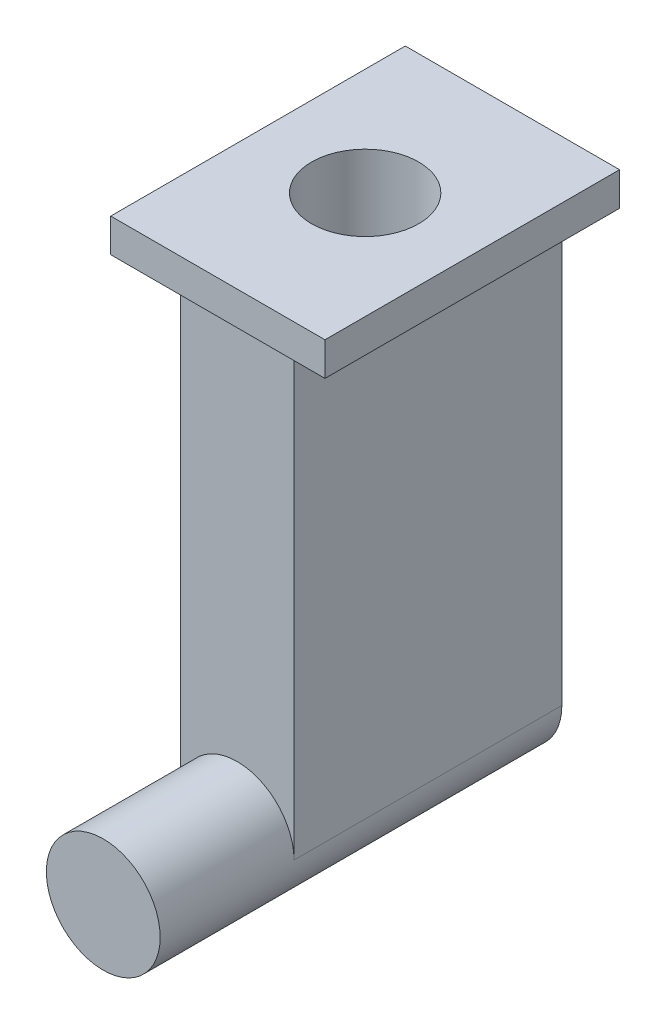
ISO-10303-21;
HEADER;
FILE_DESCRIPTION(('STEP AP214'),'2;1');
FILE_NAME('part.step','',(''),(''),'','','');
FILE_SCHEMA(('AUTOMOTIVE_DESIGN { 1 0 10303 214 1 1 1 1 }'));
ENDSEC;
DATA;
#1=APPLICATION_CONTEXT('core data for automotive mechanical design processes');
#2=APPLICATION_PROTOCOL_DEFINITION('international standard','automotive_design',2000,#1);
#3=PRODUCT_CONTEXT('',#1,'mechanical');
#4=PRODUCT('Part','Part','',(#3));
#5=PRODUCT_RELATED_PRODUCT_CATEGORY('part','',(#4));
#6=PRODUCT_DEFINITION_FORMATION('','',#4);
#7=PRODUCT_DEFINITION_CONTEXT('part definition',#1,'design');
#8=PRODUCT_DEFINITION('design','',#6,#7);
#9=PRODUCT_DEFINITION_SHAPE('','',#8);
#10=(LENGTH_UNIT() NAMED_UNIT(*) SI_UNIT(.MILLI.,.METRE.));
#11=(NAMED_UNIT(*) PLANE_ANGLE_UNIT() SI_UNIT($,.RADIAN.));
#12=(NAMED_UNIT(*) SI_UNIT($,.STERADIAN.) SOLID_ANGLE_UNIT());
#13=UNCERTAINTY_MEASURE_WITH_UNIT(LENGTH_MEASURE(1.E-05),#10,'distance_accuracy_value','');
#14=(GEOMETRIC_REPRESENTATION_CONTEXT(3) GLOBAL_UNCERTAINTY_ASSIGNED_CONTEXT((#13)) GLOBAL_UNIT_ASSIGNED_CONTEXT((#10,
#11,#12)) REPRESENTATION_CONTEXT('',''));
#15=CARTESIAN_POINT('',(0.,0.,0.));
#16=DIRECTION('',(0.,0.,1.));
#17=DIRECTION('',(1.,0.,0.));
#18=AXIS2_PLACEMENT_3D('',#15,#16,#17);
#19=CARTESIAN_POINT('',(0.,0.,-100.));
#20=DIRECTION('',(0.,0.,1.));
#21=DIRECTION('',(1.,0.,0.));
#22=AXIS2_PLACEMENT_3D('',#19,#20,#21);
#23=CYLINDRICAL_SURFACE('',#22,42.5);
#24=CARTESIAN_POINT('',(0.,0.,-100.));
#25=DIRECTION('',(0.,0.,1.));
#26=DIRECTION('',(1.,0.,0.));
#27=AXIS2_PLACEMENT_3D('',#24,#25,#26);
#28=CIRCLE('',#27,42.5);
#29=CARTESIAN_POINT('',(42.5,0.,-100.));
#30=VERTEX_POINT('',#29);
#31=CARTESIAN_POINT('',(-42.5,0.,-100.));
#32=VERTEX_POINT('',#31);
#33=EDGE_CURVE('E44',#30,#32,#28,.T.);
#34=ORIENTED_EDGE('',*,*,#33,.T.);
#35=DIRECTION('',(0.,0.,1.));
#36=VECTOR('',#35,1.);
#37=CARTESIAN_POINT('',(-42.5,0.,-300.));
#38=LINE('',#37,#36);
#39=CARTESIAN_POINT('',(-42.5,0.,-300.));
#40=VERTEX_POINT('',#39);
#41=EDGE_CURVE('E151',#40,#32,#38,.T.);
#42=ORIENTED_EDGE('',*,*,#41,.F.);
#43=CARTESIAN_POINT('',(0.,0.,-300.));
#44=DIRECTION('',(0.,0.,-1.));
#45=DIRECTION('',(-1.,0.,0.));
#46=AXIS2_PLACEMENT_3D('',#43,#44,#45);
#47=CIRCLE('',#46,42.5);
#48=CARTESIAN_POINT('',(42.5,0.,-300.));
#49=VERTEX_POINT('',#48);
#50=EDGE_CURVE('E138',#49,#40,#47,.T.);
#51=ORIENTED_EDGE('',*,*,#50,.F.);
#52=DIRECTION('',(0.,0.,1.));
#53=VECTOR('',#52,1.);
#54=CARTESIAN_POINT('',(42.5,0.,-300.));
#55=LINE('',#54,#53);
#56=EDGE_CURVE('E146',#49,#30,#55,.T.);
#57=ORIENTED_EDGE('',*,*,#56,.T.);
#58=EDGE_LOOP('',(#34,#42,#51,#57));
#59=FACE_BOUND('',#58,.T.);
#60=CARTESIAN_POINT('',(0.,0.,0.));
#61=DIRECTION('',(0.,0.,1.));
#62=DIRECTION('',(1.,0.,0.));
#63=AXIS2_PLACEMENT_3D('',#60,#61,#62);
#64=CIRCLE('',#63,42.5);
#65=CARTESIAN_POINT('',(42.5,0.,0.));
#66=VERTEX_POINT('',#65);
#67=EDGE_CURVE('E154',#66,#66,#64,.T.);
#68=ORIENTED_EDGE('',*,*,#67,.F.);
#69=EDGE_LOOP('',(#68));
#70=FACE_BOUND('',#69,.T.);
#71=ADVANCED_FACE('F37',(#59,#70),#23,.T.);
#72=CARTESIAN_POINT('',(0.,0.,0.));
#73=DIRECTION('',(0.,0.,1.));
#74=DIRECTION('',(1.,0.,0.));
#75=AXIS2_PLACEMENT_3D('',#72,#73,#74);
#76=PLANE('',#75);
#77=ORIENTED_EDGE('',*,*,#67,.T.);
#78=EDGE_LOOP('',(#77));
#79=FACE_BOUND('',#78,.T.);
#80=ADVANCED_FACE('F159',(#79),#76,.T.);
#81=CARTESIAN_POINT('',(-42.5,0.,-300.));
#82=DIRECTION('',(1.,0.,0.));
#83=DIRECTION('',(0.,0.,-1.));
#84=AXIS2_PLACEMENT_3D('',#81,#82,#83);
#85=PLANE('',#84);
#86=DIRECTION('',(0.,1.,0.));
#87=VECTOR('',#86,1.);
#88=CARTESIAN_POINT('',(-42.5,0.,-100.));
#89=LINE('',#88,#87);
#90=CARTESIAN_POINT('',(-42.5,337.5,-100.));
#91=VERTEX_POINT('',#90);
#92=EDGE_CURVE('E137',#32,#91,#89,.T.);
#93=ORIENTED_EDGE('',*,*,#92,.T.);
#94=DIRECTION('',(0.,0.,-1.));
#95=VECTOR('',#94,1.);
#96=CARTESIAN_POINT('',(-42.5,337.5,-300.));
#97=LINE('',#96,#95);
#98=CARTESIAN_POINT('',(-42.5,337.5,-300.));
#99=VERTEX_POINT('',#98);
#100=EDGE_CURVE('E51',#91,#99,#97,.T.);
#101=ORIENTED_EDGE('',*,*,#100,.T.);
#102=DIRECTION('',(0.,1.,0.));
#103=VECTOR('',#102,1.);
#104=CARTESIAN_POINT('',(-42.5,0.,-300.));
#105=LINE('',#104,#103);
#106=EDGE_CURVE('E141',#40,#99,#105,.T.);
#107=ORIENTED_EDGE('',*,*,#106,.F.);
#108=ORIENTED_EDGE('',*,*,#41,.T.);
#109=EDGE_LOOP('',(#93,#101,#107,#108));
#110=FACE_BOUND('',#109,.T.);
#111=ADVANCED_FACE('F166',(#110),#85,.F.);
#112=CARTESIAN_POINT('',(42.5,0.,-300.));
#113=DIRECTION('',(-1.,0.,0.));
#114=DIRECTION('',(0.,0.,1.));
#115=AXIS2_PLACEMENT_3D('',#112,#113,#114);
#116=PLANE('',#115);
#117=DIRECTION('',(0.,-1.,0.));
#118=VECTOR('',#117,1.);
#119=CARTESIAN_POINT('',(42.5,0.,-300.));
#120=LINE('',#119,#118);
#121=CARTESIAN_POINT('',(42.5,337.5,-300.));
#122=VERTEX_POINT('',#121);
#123=EDGE_CURVE('E144',#122,#49,#120,.T.);
#124=ORIENTED_EDGE('',*,*,#123,.F.);
#125=DIRECTION('',(0.,0.,1.));
#126=VECTOR('',#125,1.);
#127=CARTESIAN_POINT('',(42.5,337.5,-300.));
#128=LINE('',#127,#126);
#129=CARTESIAN_POINT('',(42.5,337.5,-100.));
#130=VERTEX_POINT('',#129);
#131=EDGE_CURVE('E127',#122,#130,#128,.T.);
#132=ORIENTED_EDGE('',*,*,#131,.T.);
#133=DIRECTION('',(0.,-1.,0.));
#134=VECTOR('',#133,1.);
#135=CARTESIAN_POINT('',(42.5,0.,-100.));
#136=LINE('',#135,#134);
#137=EDGE_CURVE('E58',#130,#30,#136,.T.);
#138=ORIENTED_EDGE('',*,*,#137,.T.);
#139=ORIENTED_EDGE('',*,*,#56,.F.);
#140=EDGE_LOOP('',(#124,#132,#138,#139));
#141=FACE_BOUND('',#140,.T.);
#142=ADVANCED_FACE('F177',(#141),#116,.F.);
#143=CARTESIAN_POINT('',(0.,0.,-300.));
#144=DIRECTION('',(0.,0.,-1.));
#145=DIRECTION('',(-1.,0.,0.));
#146=AXIS2_PLACEMENT_3D('',#143,#144,#145);
#147=PLANE('',#146);
#148=DIRECTION('',(-1.,0.,0.));
#149=VECTOR('',#148,1.);
#150=CARTESIAN_POINT('',(0.,337.5,-300.));
#151=LINE('',#150,#149);
#152=EDGE_CURVE('E135',#122,#99,#151,.T.);
#153=ORIENTED_EDGE('',*,*,#152,.F.);
#154=ORIENTED_EDGE('',*,*,#123,.T.);
#155=ORIENTED_EDGE('',*,*,#50,.T.);
#156=ORIENTED_EDGE('',*,*,#106,.T.);
#157=EDGE_LOOP('',(#153,#154,#155,#156));
#158=FACE_BOUND('',#157,.T.);
#159=ADVANCED_FACE('F175',(#158),#147,.T.);
#160=CARTESIAN_POINT('',(0.,0.,-100.));
#161=DIRECTION('',(0.,0.,-1.));
#162=DIRECTION('',(-1.,0.,0.));
#163=AXIS2_PLACEMENT_3D('',#160,#161,#162);
#164=PLANE('',#163);
#165=ORIENTED_EDGE('',*,*,#137,.F.);
#166=DIRECTION('',(-1.,0.,0.));
#167=VECTOR('',#166,1.);
#168=CARTESIAN_POINT('',(0.,337.5,-100.));
#169=LINE('',#168,#167);
#170=EDGE_CURVE('E11',#130,#91,#169,.T.);
#171=ORIENTED_EDGE('',*,*,#170,.T.);
#172=ORIENTED_EDGE('',*,*,#92,.F.);
#173=ORIENTED_EDGE('',*,*,#33,.F.);
#174=EDGE_LOOP('',(#165,#171,#172,#173));
#175=FACE_BOUND('',#174,.T.);
#176=ADVANCED_FACE('F171',(#175),#164,.F.);
#177=CARTESIAN_POINT('',(80.,362.5,-85.5773193014161));
#178=DIRECTION('',(-1.,0.,0.));
#179=DIRECTION('',(0.,0.,1.));
#180=AXIS2_PLACEMENT_3D('',#177,#178,#179);
#181=PLANE('',#180);
#182=DIRECTION('',(0.,0.,-1.));
#183=VECTOR('',#182,1.);
#184=CARTESIAN_POINT('',(80.,337.5,-85.5773193014161));
#185=LINE('',#184,#183);
#186=CARTESIAN_POINT('',(80.,337.5,-85.5773193014161));
#187=VERTEX_POINT('',#186);
#188=CARTESIAN_POINT('',(80.,337.5,-305.577319301416));
#189=VERTEX_POINT('',#188);
#190=EDGE_CURVE('E126',#187,#189,#185,.T.);
#191=ORIENTED_EDGE('',*,*,#190,.T.);
#192=DIRECTION('',(0.,-1.,0.));
#193=VECTOR('',#192,1.);
#194=CARTESIAN_POINT('',(80.,362.5,-305.577319301416));
#195=LINE('',#194,#193);
#196=CARTESIAN_POINT('',(80.,362.5,-305.577319301416));
#197=VERTEX_POINT('',#196);
#198=EDGE_CURVE('E106',#197,#189,#195,.T.);
#199=ORIENTED_EDGE('',*,*,#198,.F.);
#200=DIRECTION('',(0.,0.,-1.));
#201=VECTOR('',#200,1.);
#202=CARTESIAN_POINT('',(80.,362.5,-85.5773193014161));
#203=LINE('',#202,#201);
#204=CARTESIAN_POINT('',(80.,362.5,-85.5773193014161));
#205=VERTEX_POINT('',#204);
#206=EDGE_CURVE('E113',#205,#197,#203,.T.);
#207=ORIENTED_EDGE('',*,*,#206,.F.);
#208=DIRECTION('',(0.,-1.,0.));
#209=VECTOR('',#208,1.);
#210=CARTESIAN_POINT('',(80.,362.5,-85.5773193014161));
#211=LINE('',#210,#209);
#212=EDGE_CURVE('E227',#205,#187,#211,.T.);
#213=ORIENTED_EDGE('',*,*,#212,.T.);
#214=EDGE_LOOP('',(#191,#199,#207,#213));
#215=FACE_BOUND('',#214,.T.);
#216=ADVANCED_FACE('F124',(#215),#181,.F.);
#217=CARTESIAN_POINT('',(-80.,362.5,-305.577319301416));
#218=DIRECTION('',(0.,0.,1.));
#219=DIRECTION('',(1.,0.,0.));
#220=AXIS2_PLACEMENT_3D('',#217,#218,#219);
#221=PLANE('',#220);
#222=DIRECTION('',(-1.,0.,0.));
#223=VECTOR('',#222,1.);
#224=CARTESIAN_POINT('',(-80.,337.5,-305.577319301416));
#225=LINE('',#224,#223);
#226=CARTESIAN_POINT('',(-80.,337.5,-305.577319301416));
#227=VERTEX_POINT('',#226);
#228=EDGE_CURVE('E221',#189,#227,#225,.T.);
#229=ORIENTED_EDGE('',*,*,#228,.T.);
#230=DIRECTION('',(0.,-1.,0.));
#231=VECTOR('',#230,1.);
#232=CARTESIAN_POINT('',(-80.,362.5,-305.577319301416));
#233=LINE('',#232,#231);
#234=CARTESIAN_POINT('',(-80.,362.5,-305.577319301416));
#235=VERTEX_POINT('',#234);
#236=EDGE_CURVE('E109',#235,#227,#233,.T.);
#237=ORIENTED_EDGE('',*,*,#236,.F.);
#238=DIRECTION('',(-1.,0.,0.));
#239=VECTOR('',#238,1.);
#240=CARTESIAN_POINT('',(-80.,362.5,-305.577319301416));
#241=LINE('',#240,#239);
#242=EDGE_CURVE('E102',#197,#235,#241,.T.);
#243=ORIENTED_EDGE('',*,*,#242,.F.);
#244=ORIENTED_EDGE('',*,*,#198,.T.);
#245=EDGE_LOOP('',(#229,#237,#243,#244));
#246=FACE_BOUND('',#245,.T.);
#247=ADVANCED_FACE('F104',(#246),#221,.F.);
#248=CARTESIAN_POINT('',(-80.,362.5,-85.5773193014161));
#249=DIRECTION('',(1.,0.,0.));
#250=DIRECTION('',(0.,0.,-1.));
#251=AXIS2_PLACEMENT_3D('',#248,#249,#250);
#252=PLANE('',#251);
#253=DIRECTION('',(0.,0.,1.));
#254=VECTOR('',#253,1.);
#255=CARTESIAN_POINT('',(-80.,337.5,-85.5773193014161));
#256=LINE('',#255,#254);
#257=CARTESIAN_POINT('',(-80.,337.5,-85.5773193014161));
#258=VERTEX_POINT('',#257);
#259=EDGE_CURVE('E230',#227,#258,#256,.T.);
#260=ORIENTED_EDGE('',*,*,#259,.T.);
#261=DIRECTION('',(0.,-1.,0.));
#262=VECTOR('',#261,1.);
#263=CARTESIAN_POINT('',(-80.,362.5,-85.5773193014161));
#264=LINE('',#263,#262);
#265=CARTESIAN_POINT('',(-80.,362.5,-85.5773193014161));
#266=VERTEX_POINT('',#265);
#267=EDGE_CURVE('E130',#266,#258,#264,.T.);
#268=ORIENTED_EDGE('',*,*,#267,.F.);
#269=DIRECTION('',(0.,0.,1.));
#270=VECTOR('',#269,1.);
#271=CARTESIAN_POINT('',(-80.,362.5,-85.5773193014161));
#272=LINE('',#271,#270);
#273=EDGE_CURVE('E112',#235,#266,#272,.T.);
#274=ORIENTED_EDGE('',*,*,#273,.F.);
#275=ORIENTED_EDGE('',*,*,#236,.T.);
#276=EDGE_LOOP('',(#260,#268,#274,#275));
#277=FACE_BOUND('',#276,.T.);
#278=ADVANCED_FACE('F193',(#277),#252,.F.);
#279=CARTESIAN_POINT('',(-80.,362.5,-85.5773193014161));
#280=DIRECTION('',(0.,0.,-1.));
#281=DIRECTION('',(-1.,0.,0.));
#282=AXIS2_PLACEMENT_3D('',#279,#280,#281);
#283=PLANE('',#282);
#284=DIRECTION('',(1.,0.,0.));
#285=VECTOR('',#284,1.);
#286=CARTESIAN_POINT('',(-80.,337.5,-85.5773193014161));
#287=LINE('',#286,#285);
#288=EDGE_CURVE('E122',#258,#187,#287,.T.);
#289=ORIENTED_EDGE('',*,*,#288,.T.);
#290=ORIENTED_EDGE('',*,*,#212,.F.);
#291=DIRECTION('',(1.,0.,0.));
#292=VECTOR('',#291,1.);
#293=CARTESIAN_POINT('',(-80.,362.5,-85.5773193014161));
#294=LINE('',#293,#292);
#295=EDGE_CURVE('E118',#266,#205,#294,.T.);
#296=ORIENTED_EDGE('',*,*,#295,.F.);
#297=ORIENTED_EDGE('',*,*,#267,.T.);
#298=EDGE_LOOP('',(#289,#290,#296,#297));
#299=FACE_BOUND('',#298,.T.);
#300=ADVANCED_FACE('F196',(#299),#283,.F.);
#301=CARTESIAN_POINT('',(0.,362.5,0.));
#302=DIRECTION('',(0.,-1.,0.));
#303=DIRECTION('',(0.,0.,-1.));
#304=AXIS2_PLACEMENT_3D('',#301,#302,#303);
#305=PLANE('',#304);
#306=CARTESIAN_POINT('',(0.,362.5,-195.577319301416));
#307=DIRECTION('',(0.,1.,0.));
#308=DIRECTION('',(0.,0.,1.));
#309=AXIS2_PLACEMENT_3D('',#306,#307,#308);
#310=CIRCLE('',#309,40.);
#311=CARTESIAN_POINT('',(0.,362.5,-155.577319301416));
#312=VERTEX_POINT('',#311);
#313=EDGE_CURVE('E219',#312,#312,#310,.T.);
#314=ORIENTED_EDGE('',*,*,#313,.F.);
#315=EDGE_LOOP('',(#314));
#316=FACE_BOUND('',#315,.T.);
#317=ORIENTED_EDGE('',*,*,#206,.T.);
#318=ORIENTED_EDGE('',*,*,#242,.T.);
#319=ORIENTED_EDGE('',*,*,#273,.T.);
#320=ORIENTED_EDGE('',*,*,#295,.T.);
#321=EDGE_LOOP('',(#317,#318,#319,#320));
#322=FACE_BOUND('',#321,.T.);
#323=ADVANCED_FACE('F116',(#316,#322),#305,.F.);
#324=CARTESIAN_POINT('',(0.,337.5,0.));
#325=DIRECTION('',(0.,-1.,0.));
#326=DIRECTION('',(0.,0.,-1.));
#327=AXIS2_PLACEMENT_3D('',#324,#325,#326);
#328=PLANE('',#327);
#329=ORIENTED_EDGE('',*,*,#131,.F.);
#330=ORIENTED_EDGE('',*,*,#152,.T.);
#331=ORIENTED_EDGE('',*,*,#100,.F.);
#332=ORIENTED_EDGE('',*,*,#170,.F.);
#333=EDGE_LOOP('',(#329,#330,#331,#332));
#334=FACE_BOUND('',#333,.T.);
#335=ORIENTED_EDGE('',*,*,#190,.F.);
#336=ORIENTED_EDGE('',*,*,#288,.F.);
#337=ORIENTED_EDGE('',*,*,#259,.F.);
#338=ORIENTED_EDGE('',*,*,#228,.F.);
#339=EDGE_LOOP('',(#335,#336,#337,#338));
#340=FACE_BOUND('',#339,.T.);
#341=ADVANCED_FACE('F201',(#334,#340),#328,.T.);
#342=CARTESIAN_POINT('',(0.,112.5,-195.577319301416));
#343=DIRECTION('',(0.,1.,0.));
#344=DIRECTION('',(0.,0.,1.));
#345=AXIS2_PLACEMENT_3D('',#342,#343,#344);
#346=CYLINDRICAL_SURFACE('',#345,40.);
#347=CARTESIAN_POINT('',(0.,112.5,-195.577319301416));
#348=DIRECTION('',(0.,1.,0.));
#349=DIRECTION('',(0.,0.,1.));
#350=AXIS2_PLACEMENT_3D('',#347,#348,#349);
#351=CIRCLE('',#350,40.);
#352=CARTESIAN_POINT('',(0.,112.5,-155.577319301416));
#353=VERTEX_POINT('',#352);
#354=EDGE_CURVE('E218',#353,#353,#351,.T.);
#355=ORIENTED_EDGE('',*,*,#354,.F.);
#356=EDGE_LOOP('',(#355));
#357=FACE_BOUND('',#356,.T.);
#358=ORIENTED_EDGE('',*,*,#313,.T.);
#359=EDGE_LOOP('',(#358));
#360=FACE_BOUND('',#359,.T.);
#361=ADVANCED_FACE('F204',(#357,#360),#346,.F.);
#362=CARTESIAN_POINT('',(0.,112.5,-195.577319301416));
#363=DIRECTION('',(0.,1.,0.));
#364=DIRECTION('',(0.,0.,1.));
#365=AXIS2_PLACEMENT_3D('',#362,#363,#364);
#366=PLANE('',#365);
#367=ORIENTED_EDGE('',*,*,#354,.T.);
#368=EDGE_LOOP('',(#367));
#369=FACE_BOUND('',#368,.T.);
#370=ADVANCED_FACE('F210',(#369),#366,.T.);
#371=CLOSED_SHELL('',(#71,#80,#111,#142,#159,#176,#216,#247,#278,#300,#323,#341,#361,#370));
#372=MANIFOLD_SOLID_BREP('B2',#371);
#373=ADVANCED_BREP_SHAPE_REPRESENTATION('',(#18,#372),#14);
#374=SHAPE_DEFINITION_REPRESENTATION(#9,#373);
ENDSEC;
END-ISO-10303-21;
